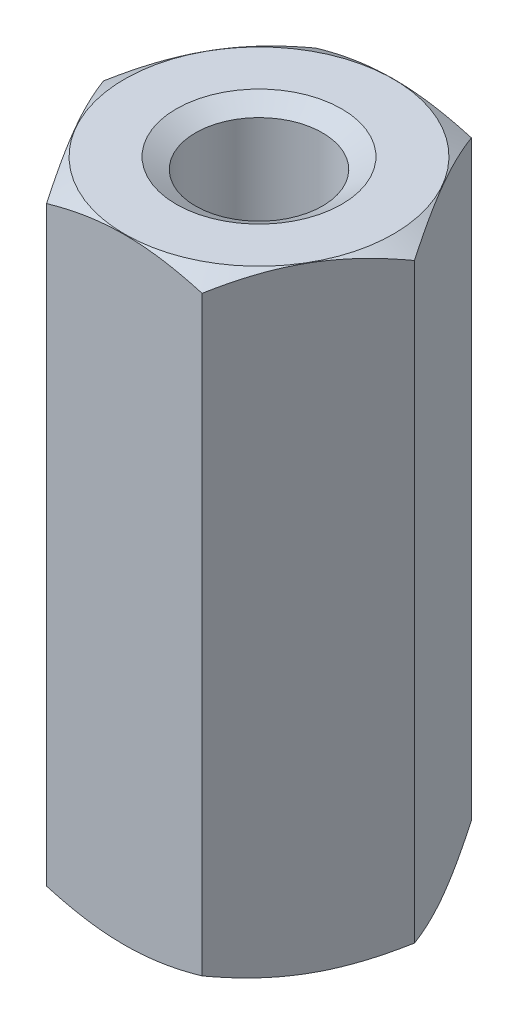
ISO-10303-21;
HEADER;
FILE_DESCRIPTION(('STEP AP214'),'2;1');
FILE_NAME('part.step','',(''),(''),'','','');
FILE_SCHEMA(('AUTOMOTIVE_DESIGN { 1 0 10303 214 1 1 1 1 }'));
ENDSEC;
DATA;
#1=APPLICATION_CONTEXT('core data for automotive mechanical design processes');
#2=APPLICATION_PROTOCOL_DEFINITION('international standard','automotive_design',2000,#1);
#3=PRODUCT_CONTEXT('',#1,'mechanical');
#4=PRODUCT('Part','Part','',(#3));
#5=PRODUCT_RELATED_PRODUCT_CATEGORY('part','',(#4));
#6=PRODUCT_DEFINITION_FORMATION('','',#4);
#7=PRODUCT_DEFINITION_CONTEXT('part definition',#1,'design');
#8=PRODUCT_DEFINITION('design','',#6,#7);
#9=PRODUCT_DEFINITION_SHAPE('','',#8);
#10=(LENGTH_UNIT() NAMED_UNIT(*) SI_UNIT(.MILLI.,.METRE.));
#11=(NAMED_UNIT(*) PLANE_ANGLE_UNIT() SI_UNIT($,.RADIAN.));
#12=(NAMED_UNIT(*) SI_UNIT($,.STERADIAN.) SOLID_ANGLE_UNIT());
#13=UNCERTAINTY_MEASURE_WITH_UNIT(LENGTH_MEASURE(1.E-05),#10,'distance_accuracy_value','');
#14=(GEOMETRIC_REPRESENTATION_CONTEXT(3) GLOBAL_UNCERTAINTY_ASSIGNED_CONTEXT((#13)) GLOBAL_UNIT_ASSIGNED_CONTEXT((#10,
#11,#12)) REPRESENTATION_CONTEXT('',''));
#15=CARTESIAN_POINT('',(0.,0.,0.));
#16=DIRECTION('',(0.,0.,1.));
#17=DIRECTION('',(1.,0.,0.));
#18=AXIS2_PLACEMENT_3D('',#15,#16,#17);
#19=CARTESIAN_POINT('',(0.,16.,0.));
#20=DIRECTION('',(0.,-1.,0.));
#21=DIRECTION('',(0.,0.,-1.));
#22=AXIS2_PLACEMENT_3D('',#19,#20,#21);
#23=CONICAL_SURFACE('',#22,3.49145188432739,1.0471975511966);
#24=CARTESIAN_POINT('',(0.,16.,0.));
#25=DIRECTION('',(0.,1.,0.));
#26=DIRECTION('',(0.,0.,1.));
#27=AXIS2_PLACEMENT_3D('',#24,#25,#26);
#28=CIRCLE('',#27,3.49145188432739);
#29=CARTESIAN_POINT('',(0.,16.,3.49145188432739));
#30=VERTEX_POINT('',#29);
#31=EDGE_CURVE('E203',#30,#30,#28,.T.);
#32=ORIENTED_EDGE('',*,*,#31,.F.);
#33=EDGE_LOOP('',(#32));
#34=FACE_BOUND('',#33,.T.);
#35=CARTESIAN_POINT('',(-5.35857849374373,14.3205521510925,3.5));
#36=CARTESIAN_POINT('',(-5.20491403045751,14.3948084648271,3.5));
#37=CARTESIAN_POINT('',(-5.05088617612491,14.4683263995164,3.5));
#38=CARTESIAN_POINT('',(-4.74190719649084,14.6134635596016,3.5));
#39=CARTESIAN_POINT('',(-4.58695591687624,14.6850824560959,3.5));
#40=CARTESIAN_POINT('',(-4.27509622552099,14.8263770302396,3.5));
#41=CARTESIAN_POINT('',(-4.11818168783656,14.8960392357975,3.5));
#42=CARTESIAN_POINT('',(-3.80306265969025,15.0323704999176,3.5));
#43=CARTESIAN_POINT('',(-3.64485823700231,15.0990397145572,3.5));
#44=CARTESIAN_POINT('',(-3.32494702244885,15.229379278542,3.5));
#45=CARTESIAN_POINT('',(-3.16322106960971,15.293002856358,3.5));
#46=CARTESIAN_POINT('',(-2.83786134873817,15.4152653168863,3.5));
#47=CARTESIAN_POINT('',(-2.674227370713,15.4739036449315,3.5));
#48=CARTESIAN_POINT('',(-2.34512758170167,15.5846195099209,3.5));
#49=CARTESIAN_POINT('',(-2.17966651365921,15.6367110010357,3.5));
#50=CARTESIAN_POINT('',(-1.84639216513062,15.7326409859786,3.5));
#51=CARTESIAN_POINT('',(-1.67857964681101,15.776482090398,3.5));
#52=CARTESIAN_POINT('',(-1.3404875008226,15.8537825659073,3.5));
#53=CARTESIAN_POINT('',(-1.17020722053808,15.8872391362949,3.5));
#54=CARTESIAN_POINT('',(-0.827594432363128,15.9415173336985,3.5));
#55=CARTESIAN_POINT('',(-0.655261922535625,15.9623389487876,3.5));
#56=CARTESIAN_POINT('',(-0.310537346323203,15.989505232516,3.5));
#57=CARTESIAN_POINT('',(-0.138152684693773,15.9959414800299,3.5));
#58=CARTESIAN_POINT('',(0.206494795849499,15.9939953970411,3.5));
#59=CARTESIAN_POINT('',(0.378757634768912,15.9856169096113,3.5));
#60=CARTESIAN_POINT('',(0.672942945410752,15.9592467693394,3.5));
#61=CARTESIAN_POINT('',(0.795190021295252,15.9446845209183,3.5));
#62=CARTESIAN_POINT('',(1.03873939048154,15.9090466412884,3.5));
#63=CARTESIAN_POINT('',(1.16004153159819,15.8879699822705,3.5));
#64=CARTESIAN_POINT('',(1.5224319169765,15.8160745949981,3.5));
#65=CARTESIAN_POINT('',(1.76182098336091,15.7566089830673,3.5));
#66=CARTESIAN_POINT('',(2.12002898254786,15.6540526908981,3.5));
#67=CARTESIAN_POINT('',(2.24071521648909,15.6171183640755,3.5));
#68=CARTESIAN_POINT('',(2.48082802657997,15.5395964927002,3.5));
#69=CARTESIAN_POINT('',(2.60025540911667,15.4990114684414,3.5));
#70=CARTESIAN_POINT('',(2.83735110002758,15.4150325899067,3.5));
#71=CARTESIAN_POINT('',(2.95502552628632,15.3716558339884,3.5));
#72=CARTESIAN_POINT('',(3.18946150672283,15.2823572835832,3.5));
#73=CARTESIAN_POINT('',(3.306222669648,15.2364344599011,3.49999999999999));
#74=CARTESIAN_POINT('',(3.42256171440309,15.1894898821739,3.49999999999999));
#75=B_SPLINE_CURVE_WITH_KNOTS('',3,(#35,#36,#37,#38,#39,#40,#41,#42,#43,#44,#45,#46,#47,#48,#49,
#50,#51,#52,#53,#54,#55,#56,#57,#58,#59,#60,#61,#62,#63,#64,#65,#66,#67,#68,#69,#70,#71,#72,#73,
#74),.UNSPECIFIED.,.F.,.F.,(4,2,2,2,2,2,2,2,2,2,2,2,2,2,2,2,2,2,2,4),(0.,0.5120038559189,
1.02409581608737,1.539119467441,2.05411623028968,2.57542513631851,3.09679196832838,
3.61702798194109,4.13709910441738,4.65731036812195,5.17752212288783,5.69441260264371,
6.21116901612508,6.58032281298953,6.94953488274052,7.68850876311463,8.06711286361378,
8.44545756824513,8.8216723978053,9.19804042922899),.UNSPECIFIED.);
#76=CARTESIAN_POINT('',(-2.0207259421637,15.6824573519457,3.5));
#77=VERTEX_POINT('',#76);
#78=CARTESIAN_POINT('',(2.02072594216372,15.6824573519457,3.5));
#79=VERTEX_POINT('',#78);
#80=EDGE_CURVE('E87',#77,#79,#75,.T.);
#81=ORIENTED_EDGE('',*,*,#80,.T.);
#82=CARTESIAN_POINT('',(2.02061047210985,15.682390682422,3.5002));
#83=CARTESIAN_POINT('',(2.10941108799267,15.7336789541254,3.34639282154755));
#84=CARTESIAN_POINT('',(2.19897822522909,15.7803237892992,3.19125798916557));
#85=CARTESIAN_POINT('',(2.37966345361545,15.861742867582,2.87830199342322));
#86=CARTESIAN_POINT('',(2.47078475532382,15.8964883075308,2.7204752692125));
#87=CARTESIAN_POINT('',(2.65189807961073,15.9505747159325,2.40677778961987));
#88=CARTESIAN_POINT('',(2.74186223545399,15.970275656855,2.25095530083931));
#89=CARTESIAN_POINT('',(2.92221386641056,15.9937946103781,1.93857711279463));
#90=CARTESIAN_POINT('',(3.01260068598001,15.9976320985698,1.78202254896577));
#91=CARTESIAN_POINT('',(3.1814939814933,15.9896494412384,1.48949078007901));
#92=CARTESIAN_POINT('',(3.26002573814992,15.9797893090457,1.3534697875421));
#93=CARTESIAN_POINT('',(3.41657761679353,15.948538276216,1.08231397971101));
#94=CARTESIAN_POINT('',(3.49459719728457,15.9271366998296,0.947180102315324));
#95=CARTESIAN_POINT('',(3.65147186489428,15.8736343352348,0.675465207594826));
#96=CARTESIAN_POINT('',(3.73030709667643,15.8413067486703,0.538918580721675));
#97=CARTESIAN_POINT('',(3.88680174018323,15.7679358093074,0.267861907055511));
#98=CARTESIAN_POINT('',(3.96446315689008,15.7269096965455,0.133348387531476));
#99=CARTESIAN_POINT('',(4.04156735438121,15.682390682422,-0.000199999999985775));
#100=B_SPLINE_CURVE_WITH_KNOTS('',3,(#82,#83,#84,#85,#86,#87,#88,#89,#90,#91,#92,#93,#94,#95,
#96,#97,#98,#99),.UNSPECIFIED.,.F.,.F.,(4,2,2,2,2,2,2,2,4),(0.,0.554793832886252,
1.11092123814983,1.65328467083218,2.19498204478402,2.66665130850859,3.13875761298266,
3.62133612600508,4.10296698719185),.UNSPECIFIED.);
#101=CARTESIAN_POINT('',(4.04145188432737,15.6824573519457,0.));
#102=VERTEX_POINT('',#101);
#103=EDGE_CURVE('E195',#79,#102,#100,.T.);
#104=ORIENTED_EDGE('',*,*,#103,.T.);
#105=CARTESIAN_POINT('',(4.04156735438121,15.682390682422,0.000200000000013609));
#106=CARTESIAN_POINT('',(3.95276673849839,15.7336789541254,-0.153607178452436));
#107=CARTESIAN_POINT('',(3.86319960126197,15.7803237892992,-0.308742010834409));
#108=CARTESIAN_POINT('',(3.68251437287562,15.861742867582,-0.621698006576766));
#109=CARTESIAN_POINT('',(3.59139307116724,15.8964883075308,-0.77952473078748));
#110=CARTESIAN_POINT('',(3.41027974688033,15.9505747159325,-1.09322221038011));
#111=CARTESIAN_POINT('',(3.32031559103707,15.970275656855,-1.24904469916068));
#112=CARTESIAN_POINT('',(3.13996396008051,15.9937946103781,-1.56142288720536));
#113=CARTESIAN_POINT('',(3.04957714051105,15.9976320985698,-1.71797745103421));
#114=CARTESIAN_POINT('',(2.88068384499777,15.9896494412384,-2.01050921992097));
#115=CARTESIAN_POINT('',(2.80215208834114,15.9797893090458,-2.14653021245789));
#116=CARTESIAN_POINT('',(2.64560020969753,15.948538276216,-2.41768602028898));
#117=CARTESIAN_POINT('',(2.56758062920649,15.9271366998296,-2.55281989768467));
#118=CARTESIAN_POINT('',(2.41070596159677,15.8736343352348,-2.82453479240518));
#119=CARTESIAN_POINT('',(2.33187072981462,15.8413067486703,-2.96108141927833));
#120=CARTESIAN_POINT('',(2.17537608630781,15.7679358093074,-3.2321380929445));
#121=CARTESIAN_POINT('',(2.09771466960097,15.7269096965455,-3.36665161246854));
#122=CARTESIAN_POINT('',(2.02061047210983,15.682390682422,-3.5002));
#123=B_SPLINE_CURVE_WITH_KNOTS('',3,(#105,#106,#107,#108,#109,#110,#111,#112,#113,#114,#115,
#116,#117,#118,#119,#120,#121,#122),.UNSPECIFIED.,.F.,.F.,(4,2,2,2,2,2,2,2,4),(0.,
0.554793832886252,1.11092123814983,1.65328467083218,2.19498204478402,2.6666513085086,
3.13875761298268,3.62133612600511,4.10296698719189),.UNSPECIFIED.);
#124=CARTESIAN_POINT('',(2.02072594216367,15.6824573519457,-3.5));
#125=VERTEX_POINT('',#124);
#126=EDGE_CURVE('E189',#102,#125,#123,.T.);
#127=ORIENTED_EDGE('',*,*,#126,.T.);
#128=CARTESIAN_POINT('',(-5.35857849374374,14.3205521510925,-3.5));
#129=CARTESIAN_POINT('',(-5.20491403045751,14.3948084648271,-3.5));
#130=CARTESIAN_POINT('',(-5.05088617612491,14.4683263995164,-3.5));
#131=CARTESIAN_POINT('',(-4.74190719649084,14.6134635596016,-3.5));
#132=CARTESIAN_POINT('',(-4.58695591687624,14.6850824560959,-3.5));
#133=CARTESIAN_POINT('',(-4.27509622552099,14.8263770302396,-3.5));
#134=CARTESIAN_POINT('',(-4.11818168783656,14.8960392357975,-3.5));
#135=CARTESIAN_POINT('',(-3.80306265969026,15.0323704999176,-3.5));
#136=CARTESIAN_POINT('',(-3.64485823700231,15.0990397145572,-3.5));
#137=CARTESIAN_POINT('',(-3.32494702244886,15.229379278542,-3.5));
#138=CARTESIAN_POINT('',(-3.16322106960971,15.293002856358,-3.5));
#139=CARTESIAN_POINT('',(-2.83786134873818,15.4152653168863,-3.5));
#140=CARTESIAN_POINT('',(-2.674227370713,15.4739036449315,-3.5));
#141=CARTESIAN_POINT('',(-2.34512758170167,15.5846195099209,-3.5));
#142=CARTESIAN_POINT('',(-2.17966651365921,15.6367110010357,-3.5));
#143=CARTESIAN_POINT('',(-1.84639216513062,15.7326409859786,-3.5));
#144=CARTESIAN_POINT('',(-1.67857964681101,15.776482090398,-3.5));
#145=CARTESIAN_POINT('',(-1.3404875008226,15.8537825659073,-3.5));
#146=CARTESIAN_POINT('',(-1.17020722053807,15.8872391362949,-3.5));
#147=CARTESIAN_POINT('',(-0.827594432363126,15.9415173336985,-3.5));
#148=CARTESIAN_POINT('',(-0.655261922535623,15.9623389487876,-3.5));
#149=CARTESIAN_POINT('',(-0.310537346323201,15.989505232516,-3.5));
#150=CARTESIAN_POINT('',(-0.13815268469377,15.9959414800299,-3.5));
#151=CARTESIAN_POINT('',(0.206494795849502,15.9939953970411,-3.5));
#152=CARTESIAN_POINT('',(0.378757634768915,15.9856169096113,-3.5));
#153=CARTESIAN_POINT('',(0.672942945410755,15.9592467693394,-3.5));
#154=CARTESIAN_POINT('',(0.795190021295255,15.9446845209183,-3.5));
#155=CARTESIAN_POINT('',(1.03873939048154,15.9090466412884,-3.5));
#156=CARTESIAN_POINT('',(1.1600415315982,15.8879699822705,-3.5));
#157=CARTESIAN_POINT('',(1.5224319169765,15.8160745949981,-3.5));
#158=CARTESIAN_POINT('',(1.76182098336091,15.7566089830673,-3.5));
#159=CARTESIAN_POINT('',(2.12002898254786,15.6540526908981,-3.5));
#160=CARTESIAN_POINT('',(2.2407152164891,15.6171183640755,-3.5));
#161=CARTESIAN_POINT('',(2.48082802657998,15.5395964927002,-3.5));
#162=CARTESIAN_POINT('',(2.60025540911667,15.4990114684414,-3.5));
#163=CARTESIAN_POINT('',(2.83735110002759,15.4150325899067,-3.5));
#164=CARTESIAN_POINT('',(2.95502552628633,15.3716558339884,-3.5));
#165=CARTESIAN_POINT('',(3.18946150672284,15.2823572835832,-3.5));
#166=CARTESIAN_POINT('',(3.30622266964801,15.2364344599011,-3.5));
#167=CARTESIAN_POINT('',(3.4225617144031,15.1894898821739,-3.5));
#168=B_SPLINE_CURVE_WITH_KNOTS('',3,(#128,#129,#130,#131,#132,#133,#134,#135,#136,#137,#138,
#139,#140,#141,#142,#143,#144,#145,#146,#147,#148,#149,#150,#151,#152,#153,#154,#155,#156,#157,
#158,#159,#160,#161,#162,#163,#164,#165,#166,#167),.UNSPECIFIED.,.F.,.F.,(4,2,2,2,2,2,2,2,2,2,2,
2,2,2,2,2,2,2,2,4),(0.,0.512003855918901,1.02409581608737,1.539119467441,2.05411623028969,
2.57542513631852,3.09679196832838,3.6170279819411,4.13709910441739,4.65731036812196,
5.17752212288784,5.69441260264372,6.21116901612509,6.58032281298954,6.94953488274054,
7.68850876311464,8.0671128636138,8.44545756824515,8.82167239780532,9.19804042922901),.UNSPECIFIED.);
#169=CARTESIAN_POINT('',(-2.0207259421637,15.6824573519457,-3.5));
#170=VERTEX_POINT('',#169);
#171=EDGE_CURVE('E108',#125,#170,#168,.F.);
#172=ORIENTED_EDGE('',*,*,#171,.T.);
#173=CARTESIAN_POINT('',(-2.02061047210986,15.682390682422,-3.5002));
#174=CARTESIAN_POINT('',(-2.10941108799268,15.7336789541254,-3.34639282154755));
#175=CARTESIAN_POINT('',(-2.1989782252291,15.7803237892992,-3.19125798916558));
#176=CARTESIAN_POINT('',(-2.37966345361546,15.861742867582,-2.87830199342322));
#177=CARTESIAN_POINT('',(-2.47078475532383,15.8964883075308,-2.72047526921251));
#178=CARTESIAN_POINT('',(-2.65189807961075,15.9505747159325,-2.40677778961987));
#179=CARTESIAN_POINT('',(-2.741862235454,15.970275656855,-2.25095530083931));
#180=CARTESIAN_POINT('',(-2.92221386641057,15.9937946103781,-1.93857711279463));
#181=CARTESIAN_POINT('',(-3.01260068598002,15.9976320985698,-1.78202254896577));
#182=CARTESIAN_POINT('',(-3.18149398149331,15.9896494412384,-1.48949078007901));
#183=CARTESIAN_POINT('',(-3.26002573814994,15.9797893090457,-1.3534697875421));
#184=CARTESIAN_POINT('',(-3.41657761679355,15.9485382762159,-1.08231397971101));
#185=CARTESIAN_POINT('',(-3.49459719728459,15.9271366998296,-0.94718010231532));
#186=CARTESIAN_POINT('',(-3.6514718648943,15.8736343352348,-0.675465207594819));
#187=CARTESIAN_POINT('',(-3.73030709667645,15.8413067486703,-0.538918580721667));
#188=CARTESIAN_POINT('',(-3.88680174018325,15.7679358093074,-0.267861907055501));
#189=CARTESIAN_POINT('',(-3.9644631568901,15.7269096965455,-0.133348387531465));
#190=CARTESIAN_POINT('',(-4.04156735438123,15.682390682422,0.000199999999998187));
#191=B_SPLINE_CURVE_WITH_KNOTS('',3,(#173,#174,#175,#176,#177,#178,#179,#180,#181,#182,#183,
#184,#185,#186,#187,#188,#189,#190),.UNSPECIFIED.,.F.,.F.,(4,2,2,2,2,2,2,2,4),(0.,
0.554793832886254,1.11092123814984,1.65328467083219,2.19498204478403,2.6666513085086,
3.13875761298267,3.6213361260051,4.10296698719187),.UNSPECIFIED.);
#192=CARTESIAN_POINT('',(-4.04145188432739,15.6824573519457,0.));
#193=VERTEX_POINT('',#192);
#194=EDGE_CURVE('E106',#170,#193,#191,.T.);
#195=ORIENTED_EDGE('',*,*,#194,.T.);
#196=CARTESIAN_POINT('',(-4.04156735438123,15.682390682422,-0.000200000000001815));
#197=CARTESIAN_POINT('',(-3.95276673849841,15.7336789541254,0.153607178452448));
#198=CARTESIAN_POINT('',(-3.86319960126199,15.7803237892992,0.308742010834422));
#199=CARTESIAN_POINT('',(-3.68251437287564,15.861742867582,0.62169800657678));
#200=CARTESIAN_POINT('',(-3.59139307116726,15.8964883075308,0.779524730787495));
#201=CARTESIAN_POINT('',(-3.41027974688035,15.9505747159325,1.09322221038013));
#202=CARTESIAN_POINT('',(-3.32031559103709,15.970275656855,1.24904469916069));
#203=CARTESIAN_POINT('',(-3.13996396008053,15.9937946103781,1.56142288720538));
#204=CARTESIAN_POINT('',(-3.04957714051107,15.9976320985698,1.71797745103423));
#205=CARTESIAN_POINT('',(-2.88068384499778,15.9896494412384,2.01050921992099));
#206=CARTESIAN_POINT('',(-2.80215208834116,15.9797893090457,2.14653021245791));
#207=CARTESIAN_POINT('',(-2.64560020969755,15.9485382762159,2.417686020289));
#208=CARTESIAN_POINT('',(-2.56758062920651,15.9271366998296,2.55281989768468));
#209=CARTESIAN_POINT('',(-2.4107059615968,15.8736343352348,2.82453479240518));
#210=CARTESIAN_POINT('',(-2.33187072981465,15.8413067486703,2.96108141927834));
#211=CARTESIAN_POINT('',(-2.17537608630784,15.7679358093074,3.2321380929445));
#212=CARTESIAN_POINT('',(-2.097714669601,15.7269096965455,3.36665161246854));
#213=CARTESIAN_POINT('',(-2.02061047210987,15.682390682422,3.5002));
#214=B_SPLINE_CURVE_WITH_KNOTS('',3,(#196,#197,#198,#199,#200,#201,#202,#203,#204,#205,#206,
#207,#208,#209,#210,#211,#212,#213),.UNSPECIFIED.,.F.,.F.,(4,2,2,2,2,2,2,2,4),(0.,
0.554793832886254,1.11092123814984,1.65328467083219,2.19498204478403,2.6666513085086,
3.13875761298267,3.6213361260051,4.10296698719187),.UNSPECIFIED.);
#215=EDGE_CURVE('E92',#193,#77,#214,.T.);
#216=ORIENTED_EDGE('',*,*,#215,.T.);
#217=EDGE_LOOP('',(#81,#104,#127,#172,#195,#216));
#218=FACE_BOUND('',#217,.T.);
#219=ADVANCED_FACE('F37',(#34,#218),#23,.T.);
#220=CARTESIAN_POINT('',(0.,0.317542648054298,0.));
#221=DIRECTION('',(0.,1.,0.));
#222=DIRECTION('',(0.,0.,1.));
#223=AXIS2_PLACEMENT_3D('',#220,#221,#222);
#224=CONICAL_SURFACE('',#223,4.04145188432739,1.0471975511966);
#225=CARTESIAN_POINT('',(0.,0.,0.));
#226=DIRECTION('',(0.,1.,0.));
#227=DIRECTION('',(0.,0.,1.));
#228=AXIS2_PLACEMENT_3D('',#225,#226,#227);
#229=CIRCLE('',#228,3.49145188432739);
#230=CARTESIAN_POINT('',(0.,0.,3.49145188432739));
#231=VERTEX_POINT('',#230);
#232=EDGE_CURVE('E229',#231,#231,#229,.F.);
#233=ORIENTED_EDGE('',*,*,#232,.F.);
#234=EDGE_LOOP('',(#233));
#235=FACE_BOUND('',#234,.T.);
#236=CARTESIAN_POINT('',(2.02061047210984,0.317609317578015,-3.5002));
#237=CARTESIAN_POINT('',(2.10941108799265,0.266321045874627,-3.34639282154755));
#238=CARTESIAN_POINT('',(2.19897822522907,0.21967621070084,-3.19125798916558));
#239=CARTESIAN_POINT('',(2.37966345361543,0.138257132417991,-2.87830199342322));
#240=CARTESIAN_POINT('',(2.4707847553238,0.103511692469203,-2.72047526921251));
#241=CARTESIAN_POINT('',(2.65189807961072,0.0494252840674772,-2.40677778961988));
#242=CARTESIAN_POINT('',(2.74186223545397,0.0297243431450222,-2.25095530083931));
#243=CARTESIAN_POINT('',(2.92221386641054,0.0062053896218941,-1.93857711279463));
#244=CARTESIAN_POINT('',(3.01260068597999,0.00236790143020458,-1.78202254896578));
#245=CARTESIAN_POINT('',(3.18149398149328,0.0103505587616164,-1.48949078007902));
#246=CARTESIAN_POINT('',(3.26002573814991,0.0202106909542457,-1.3534697875421));
#247=CARTESIAN_POINT('',(3.41657761679352,0.0514617237840421,-1.08231397971101));
#248=CARTESIAN_POINT('',(3.49459719728456,0.0728633001704369,-0.947180102315315));
#249=CARTESIAN_POINT('',(3.65147186489428,0.126365664765217,-0.675465207594811));
#250=CARTESIAN_POINT('',(3.73030709667643,0.158693251329727,-0.538918580721657));
#251=CARTESIAN_POINT('',(3.88680174018323,0.232064190692636,-0.267861907055488));
#252=CARTESIAN_POINT('',(3.96446315689008,0.273090303454509,-0.133348387531452));
#253=CARTESIAN_POINT('',(4.04156735438121,0.317609317578014,0.000200000000013888));
#254=B_SPLINE_CURVE_WITH_KNOTS('',3,(#236,#237,#238,#239,#240,#241,#242,#243,#244,#245,#246,
#247,#248,#249,#250,#251,#252,#253),.UNSPECIFIED.,.F.,.F.,(4,2,2,2,2,2,2,2,4),(0.,
0.554793832886253,1.11092123814984,1.65328467083218,2.19498204478403,2.6666513085086,
3.13875761298268,3.62133612600511,4.10296698719189),.UNSPECIFIED.);
#255=CARTESIAN_POINT('',(2.02072594216367,0.317542648054287,-3.5));
#256=VERTEX_POINT('',#255);
#257=CARTESIAN_POINT('',(4.04145188432737,0.317542648054286,0.));
#258=VERTEX_POINT('',#257);
#259=EDGE_CURVE('E169',#256,#258,#254,.T.);
#260=ORIENTED_EDGE('',*,*,#259,.T.);
#261=CARTESIAN_POINT('',(4.04156735438121,0.317609317578014,-0.000199999999986391));
#262=CARTESIAN_POINT('',(3.95276673849839,0.266321045874626,0.153607178452463));
#263=CARTESIAN_POINT('',(3.86319960126197,0.21967621070084,0.308742010834437));
#264=CARTESIAN_POINT('',(3.68251437287562,0.138257132417993,0.621698006576794));
#265=CARTESIAN_POINT('',(3.59139307116724,0.103511692469206,0.779524730787509));
#266=CARTESIAN_POINT('',(3.41027974688033,0.0494252840674816,1.09322221038014));
#267=CARTESIAN_POINT('',(3.32031559103707,0.0297243431450272,1.2490446991607));
#268=CARTESIAN_POINT('',(3.13996396008051,0.00620538962190063,1.56142288720539));
#269=CARTESIAN_POINT('',(3.04957714051105,0.00236790143021203,1.71797745103424));
#270=CARTESIAN_POINT('',(2.88068384499777,0.0103505587616252,2.010509219921));
#271=CARTESIAN_POINT('',(2.80215208834114,0.0202106909542549,2.14653021245791));
#272=CARTESIAN_POINT('',(2.64560020969753,0.0514617237840513,2.417686020289));
#273=CARTESIAN_POINT('',(2.56758062920649,0.0728633001704458,2.55281989768469));
#274=CARTESIAN_POINT('',(2.41070596159678,0.126365664765224,2.82453479240519));
#275=CARTESIAN_POINT('',(2.33187072981463,0.158693251329734,2.96108141927834));
#276=CARTESIAN_POINT('',(2.17537608630783,0.232064190692641,3.2321380929445));
#277=CARTESIAN_POINT('',(2.09771466960098,0.273090303454513,3.36665161246853));
#278=CARTESIAN_POINT('',(2.02061047210985,0.317609317578017,3.5002));
#279=B_SPLINE_CURVE_WITH_KNOTS('',3,(#261,#262,#263,#264,#265,#266,#267,#268,#269,#270,#271,
#272,#273,#274,#275,#276,#277,#278),.UNSPECIFIED.,.F.,.F.,(4,2,2,2,2,2,2,2,4),(0.,
0.554793832886253,1.11092123814983,1.65328467083218,2.19498204478403,2.66665130850859,
3.13875761298266,3.62133612600508,4.10296698719185),.UNSPECIFIED.);
#280=CARTESIAN_POINT('',(2.02072594216369,0.317542648054289,3.5));
#281=VERTEX_POINT('',#280);
#282=EDGE_CURVE('E175',#258,#281,#279,.T.);
#283=ORIENTED_EDGE('',*,*,#282,.T.);
#284=CARTESIAN_POINT('',(-5.35857849374374,1.67944784890757,3.5));
#285=CARTESIAN_POINT('',(-5.20491403045751,1.60519153517296,3.5));
#286=CARTESIAN_POINT('',(-5.05088617612491,1.53167360048365,3.5));
#287=CARTESIAN_POINT('',(-4.74190719649084,1.38653644039838,3.5));
#288=CARTESIAN_POINT('',(-4.58695591687624,1.31491754390413,3.5));
#289=CARTESIAN_POINT('',(-4.27509622552099,1.17362296976043,3.5));
#290=CARTESIAN_POINT('',(-4.11818168783656,1.10396076420257,3.5));
#291=CARTESIAN_POINT('',(-3.80306265969026,0.967629500082389,3.5));
#292=CARTESIAN_POINT('',(-3.64485823700232,0.900960285442865,3.5));
#293=CARTESIAN_POINT('',(-3.32494702244886,0.770620721458043,3.5));
#294=CARTESIAN_POINT('',(-3.16322106960971,0.706997143642037,3.5));
#295=CARTESIAN_POINT('',(-2.83786134873818,0.584734683113731,3.5));
#296=CARTESIAN_POINT('',(-2.674227370713,0.526096355068474,3.5));
#297=CARTESIAN_POINT('',(-2.34512758170167,0.415380490079071,3.5));
#298=CARTESIAN_POINT('',(-2.17966651365921,0.363288998964275,3.5));
#299=CARTESIAN_POINT('',(-1.84639216513062,0.26735901402143,3.5));
#300=CARTESIAN_POINT('',(-1.67857964681101,0.223517909602015,3.5));
#301=CARTESIAN_POINT('',(-1.3404875008226,0.146217434092662,3.5));
#302=CARTESIAN_POINT('',(-1.17020722053807,0.112760863705126,3.5));
#303=CARTESIAN_POINT('',(-0.827594432363124,0.0584826663015082,3.5));
#304=CARTESIAN_POINT('',(-0.65526192253562,0.0376610512124027,3.5));
#305=CARTESIAN_POINT('',(-0.310537346323198,0.0104947674839921,3.5));
#306=CARTESIAN_POINT('',(-0.138152684693768,0.00405851997014455,3.5));
#307=CARTESIAN_POINT('',(0.206494795849505,0.00600460295888021,3.5));
#308=CARTESIAN_POINT('',(0.378757634768918,0.0143830903886674,3.5));
#309=CARTESIAN_POINT('',(0.672942945410756,0.0407532306606453,3.5));
#310=CARTESIAN_POINT('',(0.795190021295254,0.0553154790817001,3.5));
#311=CARTESIAN_POINT('',(1.03873939048154,0.0909533587115609,3.5));
#312=CARTESIAN_POINT('',(1.16004153159819,0.112030017729551,3.5));
#313=CARTESIAN_POINT('',(1.52243191697649,0.183925405001859,3.5));
#314=CARTESIAN_POINT('',(1.76182098336089,0.243391016932728,3.5));
#315=CARTESIAN_POINT('',(2.12002898254784,0.345947309101913,3.5));
#316=CARTESIAN_POINT('',(2.24071521648907,0.382881635924508,3.5));
#317=CARTESIAN_POINT('',(2.48082802657994,0.460403507299815,3.5));
#318=CARTESIAN_POINT('',(2.60025540911663,0.500988531558587,3.5));
#319=CARTESIAN_POINT('',(2.83735110002754,0.584967410093273,3.5));
#320=CARTESIAN_POINT('',(2.95502552628628,0.628344166011571,3.5));
#321=CARTESIAN_POINT('',(3.18946150672279,0.717642716416756,3.5));
#322=CARTESIAN_POINT('',(3.30622266964796,0.763565540098899,3.49999999999999));
#323=CARTESIAN_POINT('',(3.42256171440304,0.810510117826049,3.49999999999999));
#324=B_SPLINE_CURVE_WITH_KNOTS('',3,(#284,#285,#286,#287,#288,#289,#290,#291,#292,#293,#294,
#295,#296,#297,#298,#299,#300,#301,#302,#303,#304,#305,#306,#307,#308,#309,#310,#311,#312,#313,
#314,#315,#316,#317,#318,#319,#320,#321,#322,#323),.UNSPECIFIED.,.F.,.F.,(4,2,2,2,2,2,2,2,2,2,2,
2,2,2,2,2,2,2,2,4),(0.,0.5120038559189,1.02409581608737,1.539119467441,2.05411623028968,
2.57542513631852,3.09679196832838,3.6170279819411,4.13709910441739,4.65731036812197,
5.17752212288785,5.69441260264372,6.2111690161251,6.58032281298954,6.94953488274053,
7.68850876311462,8.06711286361377,8.44545756824511,8.82167239780527,9.19804042922896),.UNSPECIFIED.);
#325=CARTESIAN_POINT('',(-2.02072594216372,0.317542648054298,3.5));
#326=VERTEX_POINT('',#325);
#327=EDGE_CURVE('E143',#281,#326,#324,.F.);
#328=ORIENTED_EDGE('',*,*,#327,.T.);
#329=CARTESIAN_POINT('',(-2.02061047210987,0.317609317578022,3.5002));
#330=CARTESIAN_POINT('',(-2.10941108799268,0.266321045874635,3.34639282154755));
#331=CARTESIAN_POINT('',(-2.19897822522911,0.219676210700848,3.19125798916557));
#332=CARTESIAN_POINT('',(-2.37966345361546,0.138257132418,2.87830199342322));
#333=CARTESIAN_POINT('',(-2.47078475532384,0.103511692469213,2.7204752692125));
#334=CARTESIAN_POINT('',(-2.65189807961075,0.0494252840674883,2.40677778961987));
#335=CARTESIAN_POINT('',(-2.74186223545401,0.0297243431450339,2.2509553008393));
#336=CARTESIAN_POINT('',(-2.92221386641057,0.0062053896219072,1.93857711279462));
#337=CARTESIAN_POINT('',(-3.01260068598003,0.00236790143021848,1.78202254896576));
#338=CARTESIAN_POINT('',(-3.18149398149331,0.0103505587616318,1.48949078007901));
#339=CARTESIAN_POINT('',(-3.26002573814994,0.0202106909542616,1.35346978754209));
#340=CARTESIAN_POINT('',(-3.41657761679355,0.0514617237840583,1.082313979711));
#341=CARTESIAN_POINT('',(-3.49459719728459,0.0728633001704529,0.947180102315314));
#342=CARTESIAN_POINT('',(-3.6514718648943,0.126365664765232,0.675465207594814));
#343=CARTESIAN_POINT('',(-3.73030709667645,0.158693251329742,0.538918580721662));
#344=CARTESIAN_POINT('',(-3.88680174018326,0.232064190692649,0.267861907055496));
#345=CARTESIAN_POINT('',(-3.9644631568901,0.273090303454522,0.133348387531461));
#346=CARTESIAN_POINT('',(-4.04156735438123,0.317609317578026,-0.000200000000001803));
#347=B_SPLINE_CURVE_WITH_KNOTS('',3,(#329,#330,#331,#332,#333,#334,#335,#336,#337,#338,#339,
#340,#341,#342,#343,#344,#345,#346),.UNSPECIFIED.,.F.,.F.,(4,2,2,2,2,2,2,2,4),(0.,
0.554793832886255,1.11092123814984,1.65328467083219,2.19498204478403,2.6666513085086,
3.13875761298267,3.6213361260051,4.10296698719187),.UNSPECIFIED.);
#348=CARTESIAN_POINT('',(-4.04145188432739,0.317542648054298,0.));
#349=VERTEX_POINT('',#348);
#350=EDGE_CURVE('E100',#326,#349,#347,.T.);
#351=ORIENTED_EDGE('',*,*,#350,.T.);
#352=CARTESIAN_POINT('',(-4.04156735438123,0.317609317578026,0.000199999999998252));
#353=CARTESIAN_POINT('',(-3.95276673849841,0.266321045874639,-0.153607178452452));
#354=CARTESIAN_POINT('',(-3.86319960126199,0.219676210700852,-0.308742010834427));
#355=CARTESIAN_POINT('',(-3.68251437287563,0.138257132418003,-0.621698006576785));
#356=CARTESIAN_POINT('',(-3.59139307116726,0.103511692469216,-0.779524730787501));
#357=CARTESIAN_POINT('',(-3.41027974688035,0.0494252840674901,-1.09322221038013));
#358=CARTESIAN_POINT('',(-3.32031559103709,0.0297243431450357,-1.2490446991607));
#359=CARTESIAN_POINT('',(-3.13996396008053,0.00620538962190842,-1.56142288720538));
#360=CARTESIAN_POINT('',(-3.04957714051107,0.00236790143021914,-1.71797745103424));
#361=CARTESIAN_POINT('',(-2.88068384499778,0.0103505587616317,-2.010509219921));
#362=CARTESIAN_POINT('',(-2.80215208834115,0.0202106909542612,-2.14653021245791));
#363=CARTESIAN_POINT('',(-2.64560020969754,0.0514617237840575,-2.417686020289));
#364=CARTESIAN_POINT('',(-2.56758062920651,0.072863300170452,-2.55281989768469));
#365=CARTESIAN_POINT('',(-2.41070596159679,0.126365664765231,-2.82453479240519));
#366=CARTESIAN_POINT('',(-2.33187072981465,0.15869325132974,-2.96108141927834));
#367=CARTESIAN_POINT('',(-2.17537608630784,0.232064190692647,-3.23213809294451));
#368=CARTESIAN_POINT('',(-2.09771466960099,0.273090303454519,-3.36665161246854));
#369=CARTESIAN_POINT('',(-2.02061047210986,0.317609317578023,-3.5002));
#370=B_SPLINE_CURVE_WITH_KNOTS('',3,(#352,#353,#354,#355,#356,#357,#358,#359,#360,#361,#362,
#363,#364,#365,#366,#367,#368,#369),.UNSPECIFIED.,.F.,.F.,(4,2,2,2,2,2,2,2,4),(0.,
0.554793832886256,1.11092123814984,1.65328467083219,2.19498204478404,2.66665130850861,
3.13875761298268,3.6213361260051,4.10296698719187),.UNSPECIFIED.);
#371=CARTESIAN_POINT('',(-2.0207259421637,0.317542648054295,-3.5));
#372=VERTEX_POINT('',#371);
#373=EDGE_CURVE('E142',#349,#372,#370,.T.);
#374=ORIENTED_EDGE('',*,*,#373,.T.);
#375=CARTESIAN_POINT('',(-5.35857849374374,1.67944784890757,-3.5));
#376=CARTESIAN_POINT('',(-5.20491403045751,1.60519153517296,-3.5));
#377=CARTESIAN_POINT('',(-5.05088617612491,1.53167360048365,-3.5));
#378=CARTESIAN_POINT('',(-4.74190719649085,1.38653644039838,-3.5));
#379=CARTESIAN_POINT('',(-4.58695591687625,1.31491754390413,-3.5));
#380=CARTESIAN_POINT('',(-4.275096225521,1.17362296976044,-3.5));
#381=CARTESIAN_POINT('',(-4.11818168783657,1.10396076420257,-3.5));
#382=CARTESIAN_POINT('',(-3.80306265969026,0.967629500082391,-3.5));
#383=CARTESIAN_POINT('',(-3.64485823700232,0.900960285442867,-3.5));
#384=CARTESIAN_POINT('',(-3.32494702244886,0.770620721458044,-3.5));
#385=CARTESIAN_POINT('',(-3.16322106960971,0.706997143642038,-3.5));
#386=CARTESIAN_POINT('',(-2.83786134873818,0.584734683113733,-3.5));
#387=CARTESIAN_POINT('',(-2.674227370713,0.526096355068476,-3.5));
#388=CARTESIAN_POINT('',(-2.34512758170167,0.415380490079072,-3.5));
#389=CARTESIAN_POINT('',(-2.17966651365921,0.363288998964277,-3.5));
#390=CARTESIAN_POINT('',(-1.84639216513062,0.267359014021431,-3.5));
#391=CARTESIAN_POINT('',(-1.67857964681101,0.223517909602017,-3.5));
#392=CARTESIAN_POINT('',(-1.3404875008226,0.146217434092665,-3.5));
#393=CARTESIAN_POINT('',(-1.17020722053807,0.112760863705129,-3.5));
#394=CARTESIAN_POINT('',(-0.827594432363125,0.058482666301511,-3.5));
#395=CARTESIAN_POINT('',(-0.655261922535621,0.0376610512124054,-3.5));
#396=CARTESIAN_POINT('',(-0.310537346323199,0.0104947674839949,-3.5));
#397=CARTESIAN_POINT('',(-0.138152684693767,0.00405851997014747,-3.5));
#398=CARTESIAN_POINT('',(0.206494795849506,0.0060046029588833,-3.5));
#399=CARTESIAN_POINT('',(0.378757634768919,0.0143830903886706,-3.5));
#400=CARTESIAN_POINT('',(0.672942945410758,0.0407532306606486,-3.5));
#401=CARTESIAN_POINT('',(0.795190021295256,0.0553154790817036,-3.5));
#402=CARTESIAN_POINT('',(1.03873939048154,0.0909533587115649,-3.5));
#403=CARTESIAN_POINT('',(1.16004153159819,0.112030017729555,-3.5));
#404=CARTESIAN_POINT('',(1.52243191697649,0.183925405001863,-3.5));
#405=CARTESIAN_POINT('',(1.7618209833609,0.243391016932733,-3.5));
#406=CARTESIAN_POINT('',(2.12002898254784,0.345947309101918,-3.5));
#407=CARTESIAN_POINT('',(2.24071521648908,0.382881635924514,-3.5));
#408=CARTESIAN_POINT('',(2.48082802657995,0.460403507299821,-3.5));
#409=CARTESIAN_POINT('',(2.60025540911664,0.500988531558593,-3.5));
#410=CARTESIAN_POINT('',(2.83735110002755,0.58496741009328,-3.5));
#411=CARTESIAN_POINT('',(2.95502552628629,0.628344166011577,-3.5));
#412=CARTESIAN_POINT('',(3.1894615067228,0.717642716416763,-3.5));
#413=CARTESIAN_POINT('',(3.30622266964797,0.763565540098906,-3.5));
#414=CARTESIAN_POINT('',(3.42256171440305,0.810510117826056,-3.5));
#415=B_SPLINE_CURVE_WITH_KNOTS('',3,(#375,#376,#377,#378,#379,#380,#381,#382,#383,#384,#385,
#386,#387,#388,#389,#390,#391,#392,#393,#394,#395,#396,#397,#398,#399,#400,#401,#402,#403,#404,
#405,#406,#407,#408,#409,#410,#411,#412,#413,#414),.UNSPECIFIED.,.F.,.F.,(4,2,2,2,2,2,2,2,2,2,2,
2,2,2,2,2,2,2,2,4),(0.,0.512003855918901,1.02409581608737,1.539119467441,2.05411623028969,
2.57542513631852,3.09679196832839,3.61702798194111,4.13709910441739,4.65731036812197,
5.17752212288785,5.69441260264373,6.21116901612511,6.58032281298955,6.94953488274054,
7.68850876311463,8.06711286361378,8.44545756824512,8.82167239780529,9.19804042922897),.UNSPECIFIED.);
#416=EDGE_CURVE('E164',#372,#256,#415,.T.);
#417=ORIENTED_EDGE('',*,*,#416,.T.);
#418=EDGE_LOOP('',(#260,#283,#328,#351,#374,#417));
#419=FACE_BOUND('',#418,.T.);
#420=ADVANCED_FACE('F152',(#235,#419),#224,.T.);
#421=CARTESIAN_POINT('',(0.,16.,0.));
#422=DIRECTION('',(0.,1.,0.));
#423=DIRECTION('',(0.,0.,1.));
#424=AXIS2_PLACEMENT_3D('',#421,#422,#423);
#425=PLANE('',#424);
#426=CARTESIAN_POINT('',(0.,16.,0.));
#427=DIRECTION('',(0.,1.,0.));
#428=DIRECTION('',(0.,0.,1.));
#429=AXIS2_PLACEMENT_3D('',#426,#427,#428);
#430=CIRCLE('',#429,2.15);
#431=CARTESIAN_POINT('',(0.,16.,2.15));
#432=VERTEX_POINT('',#431);
#433=EDGE_CURVE('E12',#432,#432,#430,.F.);
#434=ORIENTED_EDGE('',*,*,#433,.T.);
#435=EDGE_LOOP('',(#434));
#436=FACE_BOUND('',#435,.T.);
#437=ORIENTED_EDGE('',*,*,#31,.T.);
#438=EDGE_LOOP('',(#437));
#439=FACE_BOUND('',#438,.T.);
#440=ADVANCED_FACE('F155',(#436,#439),#425,.T.);
#441=CARTESIAN_POINT('',(0.,0.,0.));
#442=DIRECTION('',(0.,1.,0.));
#443=DIRECTION('',(0.,0.,1.));
#444=AXIS2_PLACEMENT_3D('',#441,#442,#443);
#445=PLANE('',#444);
#446=CARTESIAN_POINT('',(0.,0.,0.));
#447=DIRECTION('',(0.,1.,0.));
#448=DIRECTION('',(0.,0.,1.));
#449=AXIS2_PLACEMENT_3D('',#446,#447,#448);
#450=CIRCLE('',#449,1.93867513459481);
#451=CARTESIAN_POINT('',(0.,0.,1.93867513459481));
#452=VERTEX_POINT('',#451);
#453=EDGE_CURVE('E303',#452,#452,#450,.T.);
#454=ORIENTED_EDGE('',*,*,#453,.T.);
#455=EDGE_LOOP('',(#454));
#456=FACE_BOUND('',#455,.T.);
#457=ORIENTED_EDGE('',*,*,#232,.T.);
#458=EDGE_LOOP('',(#457));
#459=FACE_BOUND('',#458,.T.);
#460=ADVANCED_FACE('F212',(#456,#459),#445,.F.);
#461=CARTESIAN_POINT('',(0.,16.,0.));
#462=DIRECTION('',(0.,-1.,0.));
#463=DIRECTION('',(0.,0.,-1.));
#464=AXIS2_PLACEMENT_3D('',#461,#462,#463);
#465=CYLINDRICAL_SURFACE('',#464,1.65);
#466=CARTESIAN_POINT('',(0.,0.500000000000002,0.));
#467=DIRECTION('',(0.,1.,0.));
#468=DIRECTION('',(0.,0.,1.));
#469=AXIS2_PLACEMENT_3D('',#466,#467,#468);
#470=CIRCLE('',#469,1.65);
#471=CARTESIAN_POINT('',(0.,0.500000000000002,1.65));
#472=VERTEX_POINT('',#471);
#473=EDGE_CURVE('E45',#472,#472,#470,.F.);
#474=ORIENTED_EDGE('',*,*,#473,.T.);
#475=EDGE_LOOP('',(#474));
#476=FACE_BOUND('',#475,.T.);
#477=CARTESIAN_POINT('',(0.,15.7113248654052,0.));
#478=DIRECTION('',(0.,1.,0.));
#479=DIRECTION('',(0.,0.,1.));
#480=AXIS2_PLACEMENT_3D('',#477,#478,#479);
#481=CIRCLE('',#480,1.65);
#482=CARTESIAN_POINT('',(0.,15.7113248654052,1.65));
#483=VERTEX_POINT('',#482);
#484=EDGE_CURVE('E301',#483,#483,#481,.T.);
#485=ORIENTED_EDGE('',*,*,#484,.T.);
#486=EDGE_LOOP('',(#485));
#487=FACE_BOUND('',#486,.T.);
#488=ADVANCED_FACE('F207',(#476,#487),#465,.F.);
#489=CARTESIAN_POINT('',(2.02072594216369,16.,3.5));
#490=DIRECTION('',(0.866025403784439,0.,0.5));
#491=DIRECTION('',(0.5,0.,-0.866025403784439));
#492=AXIS2_PLACEMENT_3D('',#489,#490,#491);
#493=PLANE('',#492);
#494=DIRECTION('',(0.,-1.,0.));
#495=VECTOR('',#494,1.);
#496=CARTESIAN_POINT('',(2.02072594216369,16.,3.5));
#497=LINE('',#496,#495);
#498=EDGE_CURVE('E52',#79,#281,#497,.T.);
#499=ORIENTED_EDGE('',*,*,#498,.T.);
#500=ORIENTED_EDGE('',*,*,#282,.F.);
#501=DIRECTION('',(0.,-1.,0.));
#502=VECTOR('',#501,1.);
#503=CARTESIAN_POINT('',(4.04145188432737,16.,0.));
#504=LINE('',#503,#502);
#505=EDGE_CURVE('E93',#102,#258,#504,.T.);
#506=ORIENTED_EDGE('',*,*,#505,.F.);
#507=ORIENTED_EDGE('',*,*,#103,.F.);
#508=EDGE_LOOP('',(#499,#500,#506,#507));
#509=FACE_BOUND('',#508,.T.);
#510=ADVANCED_FACE('F184',(#509),#493,.T.);
#511=CARTESIAN_POINT('',(4.04145188432737,16.,0.));
#512=DIRECTION('',(0.866025403784439,0.,-0.5));
#513=DIRECTION('',(-0.5,0.,-0.866025403784439));
#514=AXIS2_PLACEMENT_3D('',#511,#512,#513);
#515=PLANE('',#514);
#516=ORIENTED_EDGE('',*,*,#505,.T.);
#517=ORIENTED_EDGE('',*,*,#259,.F.);
#518=DIRECTION('',(0.,-1.,0.));
#519=VECTOR('',#518,1.);
#520=CARTESIAN_POINT('',(2.02072594216367,16.,-3.5));
#521=LINE('',#520,#519);
#522=EDGE_CURVE('E242',#125,#256,#521,.T.);
#523=ORIENTED_EDGE('',*,*,#522,.F.);
#524=ORIENTED_EDGE('',*,*,#126,.F.);
#525=EDGE_LOOP('',(#516,#517,#523,#524));
#526=FACE_BOUND('',#525,.T.);
#527=ADVANCED_FACE('F180',(#526),#515,.T.);
#528=CARTESIAN_POINT('',(2.02072594216367,16.,-3.5));
#529=DIRECTION('',(0.,0.,-1.));
#530=DIRECTION('',(-1.,0.,0.));
#531=AXIS2_PLACEMENT_3D('',#528,#529,#530);
#532=PLANE('',#531);
#533=ORIENTED_EDGE('',*,*,#522,.T.);
#534=ORIENTED_EDGE('',*,*,#416,.F.);
#535=DIRECTION('',(0.,-1.,0.));
#536=VECTOR('',#535,1.);
#537=CARTESIAN_POINT('',(-2.0207259421637,16.,-3.5));
#538=LINE('',#537,#536);
#539=EDGE_CURVE('E239',#170,#372,#538,.T.);
#540=ORIENTED_EDGE('',*,*,#539,.F.);
#541=ORIENTED_EDGE('',*,*,#171,.F.);
#542=EDGE_LOOP('',(#533,#534,#540,#541));
#543=FACE_BOUND('',#542,.T.);
#544=ADVANCED_FACE('F183',(#543),#532,.T.);
#545=CARTESIAN_POINT('',(-2.0207259421637,16.,-3.5));
#546=DIRECTION('',(-0.866025403784438,0.,-0.5));
#547=DIRECTION('',(-0.5,0.,0.866025403784439));
#548=AXIS2_PLACEMENT_3D('',#545,#546,#547);
#549=PLANE('',#548);
#550=ORIENTED_EDGE('',*,*,#539,.T.);
#551=ORIENTED_EDGE('',*,*,#373,.F.);
#552=DIRECTION('',(0.,-1.,0.));
#553=VECTOR('',#552,1.);
#554=CARTESIAN_POINT('',(-4.04145188432739,16.,0.));
#555=LINE('',#554,#553);
#556=EDGE_CURVE('E102',#193,#349,#555,.T.);
#557=ORIENTED_EDGE('',*,*,#556,.F.);
#558=ORIENTED_EDGE('',*,*,#194,.F.);
#559=EDGE_LOOP('',(#550,#551,#557,#558));
#560=FACE_BOUND('',#559,.T.);
#561=ADVANCED_FACE('F130',(#560),#549,.T.);
#562=CARTESIAN_POINT('',(-4.04145188432739,16.,0.));
#563=DIRECTION('',(-0.866025403784439,0.,0.5));
#564=DIRECTION('',(0.5,0.,0.866025403784439));
#565=AXIS2_PLACEMENT_3D('',#562,#563,#564);
#566=PLANE('',#565);
#567=ORIENTED_EDGE('',*,*,#556,.T.);
#568=ORIENTED_EDGE('',*,*,#350,.F.);
#569=DIRECTION('',(0.,-1.,0.));
#570=VECTOR('',#569,1.);
#571=CARTESIAN_POINT('',(-2.0207259421637,16.,3.5));
#572=LINE('',#571,#570);
#573=EDGE_CURVE('E57',#77,#326,#572,.T.);
#574=ORIENTED_EDGE('',*,*,#573,.F.);
#575=ORIENTED_EDGE('',*,*,#215,.F.);
#576=EDGE_LOOP('',(#567,#568,#574,#575));
#577=FACE_BOUND('',#576,.T.);
#578=ADVANCED_FACE('F97',(#577),#566,.T.);
#579=CARTESIAN_POINT('',(-2.0207259421637,16.,3.5));
#580=DIRECTION('',(0.,0.,1.));
#581=DIRECTION('',(1.,0.,0.));
#582=AXIS2_PLACEMENT_3D('',#579,#580,#581);
#583=PLANE('',#582);
#584=ORIENTED_EDGE('',*,*,#573,.T.);
#585=ORIENTED_EDGE('',*,*,#327,.F.);
#586=ORIENTED_EDGE('',*,*,#498,.F.);
#587=ORIENTED_EDGE('',*,*,#80,.F.);
#588=EDGE_LOOP('',(#584,#585,#586,#587));
#589=FACE_BOUND('',#588,.T.);
#590=ADVANCED_FACE('F88',(#589),#583,.T.);
#591=CARTESIAN_POINT('',(0.,0.,0.));
#592=DIRECTION('',(0.,-1.,0.));
#593=DIRECTION('',(0.,0.,-1.));
#594=AXIS2_PLACEMENT_3D('',#591,#592,#593);
#595=CONICAL_SURFACE('',#594,1.93867513459481,0.523598775598295);
#596=ORIENTED_EDGE('',*,*,#473,.F.);
#597=EDGE_LOOP('',(#596));
#598=FACE_BOUND('',#597,.T.);
#599=ORIENTED_EDGE('',*,*,#453,.F.);
#600=EDGE_LOOP('',(#599));
#601=FACE_BOUND('',#600,.T.);
#602=ADVANCED_FACE('F157',(#598,#601),#595,.F.);
#603=CARTESIAN_POINT('',(0.,15.7113248654052,0.));
#604=DIRECTION('',(0.,1.,0.));
#605=DIRECTION('',(0.,0.,1.));
#606=AXIS2_PLACEMENT_3D('',#603,#604,#605);
#607=CONICAL_SURFACE('',#606,1.65,1.0471975511966);
#608=ORIENTED_EDGE('',*,*,#433,.F.);
#609=EDGE_LOOP('',(#608));
#610=FACE_BOUND('',#609,.T.);
#611=ORIENTED_EDGE('',*,*,#484,.F.);
#612=EDGE_LOOP('',(#611));
#613=FACE_BOUND('',#612,.T.);
#614=ADVANCED_FACE('F39',(#610,#613),#607,.F.);
#615=CLOSED_SHELL('',(#219,#420,#440,#460,#488,#510,#527,#544,#561,#578,#590,#602,#614));
#616=MANIFOLD_SOLID_BREP('B2',#615);
#617=ADVANCED_BREP_SHAPE_REPRESENTATION('',(#18,#616),#14);
#618=SHAPE_DEFINITION_REPRESENTATION(#9,#617);
ENDSEC;
END-ISO-10303-21;
